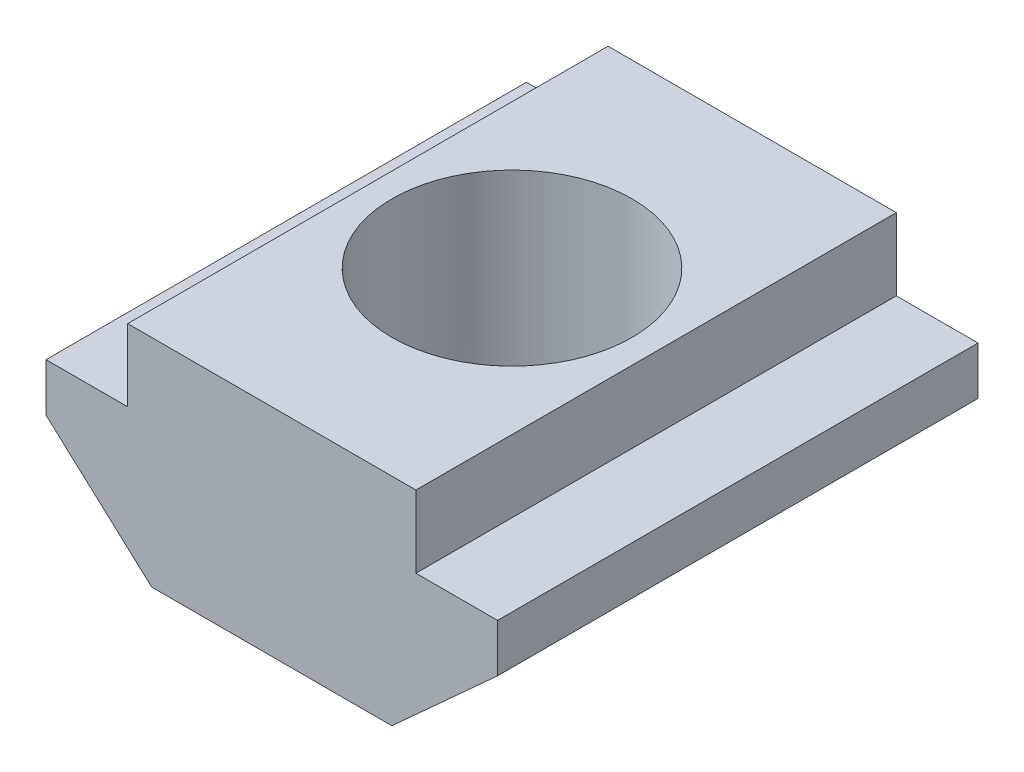
ISO-10303-21;
HEADER;
FILE_DESCRIPTION(('STEP AP214'),'2;1');
FILE_NAME('part.step','',(''),(''),'','','');
FILE_SCHEMA(('AUTOMOTIVE_DESIGN { 1 0 10303 214 1 1 1 1 }'));
ENDSEC;
DATA;
#1=APPLICATION_CONTEXT('core data for automotive mechanical design processes');
#2=APPLICATION_PROTOCOL_DEFINITION('international standard','automotive_design',2000,#1);
#3=PRODUCT_CONTEXT('',#1,'mechanical');
#4=PRODUCT('Part','Part','',(#3));
#5=PRODUCT_RELATED_PRODUCT_CATEGORY('part','',(#4));
#6=PRODUCT_DEFINITION_FORMATION('','',#4);
#7=PRODUCT_DEFINITION_CONTEXT('part definition',#1,'design');
#8=PRODUCT_DEFINITION('design','',#6,#7);
#9=PRODUCT_DEFINITION_SHAPE('','',#8);
#10=(LENGTH_UNIT() NAMED_UNIT(*) SI_UNIT(.MILLI.,.METRE.));
#11=(NAMED_UNIT(*) PLANE_ANGLE_UNIT() SI_UNIT($,.RADIAN.));
#12=(NAMED_UNIT(*) SI_UNIT($,.STERADIAN.) SOLID_ANGLE_UNIT());
#13=UNCERTAINTY_MEASURE_WITH_UNIT(LENGTH_MEASURE(1.E-05),#10,'distance_accuracy_value','');
#14=(GEOMETRIC_REPRESENTATION_CONTEXT(3) GLOBAL_UNCERTAINTY_ASSIGNED_CONTEXT((#13)) GLOBAL_UNIT_ASSIGNED_CONTEXT((#10,
#11,#12)) REPRESENTATION_CONTEXT('',''));
#15=CARTESIAN_POINT('',(0.,0.,0.));
#16=DIRECTION('',(0.,0.,1.));
#17=DIRECTION('',(1.,0.,0.));
#18=AXIS2_PLACEMENT_3D('',#15,#16,#17);
#19=CARTESIAN_POINT('',(-2.5,-4.5,5.));
#20=DIRECTION('',(0.,1.,0.));
#21=DIRECTION('',(0.,0.,1.));
#22=AXIS2_PLACEMENT_3D('',#19,#20,#21);
#23=PLANE('',#22);
#24=DIRECTION('',(0.,0.,-1.));
#25=VECTOR('',#24,1.);
#26=CARTESIAN_POINT('',(2.5,-4.5,5.));
#27=LINE('',#26,#25);
#28=CARTESIAN_POINT('',(2.5,-4.5,0.));
#29=VERTEX_POINT('',#28);
#30=CARTESIAN_POINT('',(2.5,-4.5,-5.));
#31=VERTEX_POINT('',#30);
#32=EDGE_CURVE('E181',#29,#31,#27,.T.);
#33=ORIENTED_EDGE('',*,*,#32,.F.);
#34=CARTESIAN_POINT('',(0.,-4.5,0.));
#35=DIRECTION('',(0.,1.,0.));
#36=DIRECTION('',(0.,0.,1.));
#37=AXIS2_PLACEMENT_3D('',#34,#35,#36);
#38=CIRCLE('',#37,2.5);
#39=CARTESIAN_POINT('',(-2.5,-4.5,0.));
#40=VERTEX_POINT('',#39);
#41=EDGE_CURVE('E49',#29,#40,#38,.T.);
#42=ORIENTED_EDGE('',*,*,#41,.T.);
#43=DIRECTION('',(0.,0.,-1.));
#44=VECTOR('',#43,1.);
#45=CARTESIAN_POINT('',(-2.5,-4.5,5.));
#46=LINE('',#45,#44);
#47=CARTESIAN_POINT('',(-2.5,-4.5,-5.));
#48=VERTEX_POINT('',#47);
#49=EDGE_CURVE('E185',#40,#48,#46,.T.);
#50=ORIENTED_EDGE('',*,*,#49,.T.);
#51=DIRECTION('',(1.,0.,0.));
#52=VECTOR('',#51,1.);
#53=CARTESIAN_POINT('',(-2.5,-4.5,-5.));
#54=LINE('',#53,#52);
#55=EDGE_CURVE('E163',#48,#31,#54,.T.);
#56=ORIENTED_EDGE('',*,*,#55,.T.);
#57=EDGE_LOOP('',(#33,#42,#50,#56));
#58=FACE_BOUND('',#57,.T.);
#59=ADVANCED_FACE('F35',(#58),#23,.F.);
#60=CARTESIAN_POINT('',(-3.,0.,5.));
#61=DIRECTION('',(1.,0.,0.));
#62=DIRECTION('',(0.,1.,0.));
#63=AXIS2_PLACEMENT_3D('',#60,#61,#62);
#64=PLANE('',#63);
#65=DIRECTION('',(0.,-1.,0.));
#66=VECTOR('',#65,1.);
#67=CARTESIAN_POINT('',(-3.,0.,-5.));
#68=LINE('',#67,#66);
#69=CARTESIAN_POINT('',(-3.,0.,-5.));
#70=VERTEX_POINT('',#69);
#71=CARTESIAN_POINT('',(-3.,-1.5,-5.));
#72=VERTEX_POINT('',#71);
#73=EDGE_CURVE('E153',#70,#72,#68,.T.);
#74=ORIENTED_EDGE('',*,*,#73,.T.);
#75=DIRECTION('',(0.,0.,-1.));
#76=VECTOR('',#75,1.);
#77=CARTESIAN_POINT('',(-3.,-1.5,5.));
#78=LINE('',#77,#76);
#79=CARTESIAN_POINT('',(-3.,-1.5,5.));
#80=VERTEX_POINT('',#79);
#81=EDGE_CURVE('E11',#80,#72,#78,.T.);
#82=ORIENTED_EDGE('',*,*,#81,.F.);
#83=DIRECTION('',(0.,-1.,0.));
#84=VECTOR('',#83,1.);
#85=CARTESIAN_POINT('',(-3.,0.,5.));
#86=LINE('',#85,#84);
#87=CARTESIAN_POINT('',(-3.,0.,5.));
#88=VERTEX_POINT('',#87);
#89=EDGE_CURVE('E174',#88,#80,#86,.T.);
#90=ORIENTED_EDGE('',*,*,#89,.F.);
#91=DIRECTION('',(0.,0.,-1.));
#92=VECTOR('',#91,1.);
#93=CARTESIAN_POINT('',(-3.,0.,5.));
#94=LINE('',#93,#92);
#95=EDGE_CURVE('E149',#88,#70,#94,.T.);
#96=ORIENTED_EDGE('',*,*,#95,.T.);
#97=EDGE_LOOP('',(#74,#82,#90,#96));
#98=FACE_BOUND('',#97,.T.);
#99=ADVANCED_FACE('F37',(#98),#64,.F.);
#100=CARTESIAN_POINT('',(-3.,-1.5,5.));
#101=DIRECTION('',(0.,-1.,0.));
#102=DIRECTION('',(1.,0.,0.));
#103=AXIS2_PLACEMENT_3D('',#100,#101,#102);
#104=PLANE('',#103);
#105=DIRECTION('',(-1.,0.,0.));
#106=VECTOR('',#105,1.);
#107=CARTESIAN_POINT('',(-3.,-1.5,-5.));
#108=LINE('',#107,#106);
#109=CARTESIAN_POINT('',(-4.7,-1.5,-5.));
#110=VERTEX_POINT('',#109);
#111=EDGE_CURVE('E156',#72,#110,#108,.T.);
#112=ORIENTED_EDGE('',*,*,#111,.T.);
#113=DIRECTION('',(0.,0.,-1.));
#114=VECTOR('',#113,1.);
#115=CARTESIAN_POINT('',(-4.7,-1.5,5.));
#116=LINE('',#115,#114);
#117=CARTESIAN_POINT('',(-4.7,-1.5,5.));
#118=VERTEX_POINT('',#117);
#119=EDGE_CURVE('E43',#118,#110,#116,.T.);
#120=ORIENTED_EDGE('',*,*,#119,.F.);
#121=DIRECTION('',(-1.,0.,0.));
#122=VECTOR('',#121,1.);
#123=CARTESIAN_POINT('',(-3.,-1.5,5.));
#124=LINE('',#123,#122);
#125=EDGE_CURVE('E105',#80,#118,#124,.T.);
#126=ORIENTED_EDGE('',*,*,#125,.F.);
#127=ORIENTED_EDGE('',*,*,#81,.T.);
#128=EDGE_LOOP('',(#112,#120,#126,#127));
#129=FACE_BOUND('',#128,.T.);
#130=ADVANCED_FACE('F245',(#129),#104,.F.);
#131=CARTESIAN_POINT('',(-4.7,-1.5,5.));
#132=DIRECTION('',(1.,0.,0.));
#133=DIRECTION('',(0.,1.,0.));
#134=AXIS2_PLACEMENT_3D('',#131,#132,#133);
#135=PLANE('',#134);
#136=DIRECTION('',(0.,-1.,0.));
#137=VECTOR('',#136,1.);
#138=CARTESIAN_POINT('',(-4.7,-1.5,-5.));
#139=LINE('',#138,#137);
#140=CARTESIAN_POINT('',(-4.7,-2.5,-5.));
#141=VERTEX_POINT('',#140);
#142=EDGE_CURVE('E158',#110,#141,#139,.T.);
#143=ORIENTED_EDGE('',*,*,#142,.T.);
#144=DIRECTION('',(0.,0.,-1.));
#145=VECTOR('',#144,1.);
#146=CARTESIAN_POINT('',(-4.7,-2.5,5.));
#147=LINE('',#146,#145);
#148=CARTESIAN_POINT('',(-4.7,-2.5,5.));
#149=VERTEX_POINT('',#148);
#150=EDGE_CURVE('E189',#149,#141,#147,.T.);
#151=ORIENTED_EDGE('',*,*,#150,.F.);
#152=DIRECTION('',(0.,-1.,0.));
#153=VECTOR('',#152,1.);
#154=CARTESIAN_POINT('',(-4.7,-1.5,5.));
#155=LINE('',#154,#153);
#156=EDGE_CURVE('E197',#118,#149,#155,.T.);
#157=ORIENTED_EDGE('',*,*,#156,.F.);
#158=ORIENTED_EDGE('',*,*,#119,.T.);
#159=EDGE_LOOP('',(#143,#151,#157,#158));
#160=FACE_BOUND('',#159,.T.);
#161=ADVANCED_FACE('F195',(#160),#135,.F.);
#162=CARTESIAN_POINT('',(-4.7,-2.5,5.));
#163=DIRECTION('',(0.672672793996312,0.739940073395944,0.));
#164=DIRECTION('',(-0.739940073395944,0.672672793996312,0.));
#165=AXIS2_PLACEMENT_3D('',#162,#163,#164);
#166=PLANE('',#165);
#167=DIRECTION('',(0.739940073395944,-0.672672793996312,0.));
#168=VECTOR('',#167,1.);
#169=CARTESIAN_POINT('',(-4.7,-2.5,-5.));
#170=LINE('',#169,#168);
#171=EDGE_CURVE('E160',#141,#48,#170,.T.);
#172=ORIENTED_EDGE('',*,*,#171,.T.);
#173=ORIENTED_EDGE('',*,*,#49,.F.);
#174=CARTESIAN_POINT('',(-2.5,-4.5,5.));
#175=VERTEX_POINT('',#174);
#176=EDGE_CURVE('E186',#175,#40,#46,.T.);
#177=ORIENTED_EDGE('',*,*,#176,.F.);
#178=DIRECTION('',(0.739940073395944,-0.672672793996312,0.));
#179=VECTOR('',#178,1.);
#180=CARTESIAN_POINT('',(-4.7,-2.5,5.));
#181=LINE('',#180,#179);
#182=EDGE_CURVE('E209',#149,#175,#181,.T.);
#183=ORIENTED_EDGE('',*,*,#182,.F.);
#184=ORIENTED_EDGE('',*,*,#150,.T.);
#185=EDGE_LOOP('',(#172,#173,#177,#183,#184));
#186=FACE_BOUND('',#185,.T.);
#187=ADVANCED_FACE('F206',(#186),#166,.F.);
#188=ORIENTED_EDGE('',*,*,#176,.T.);
#189=EDGE_CURVE('E235',#40,#29,#38,.T.);
#190=ORIENTED_EDGE('',*,*,#189,.T.);
#191=CARTESIAN_POINT('',(2.5,-4.5,5.));
#192=VERTEX_POINT('',#191);
#193=EDGE_CURVE('E182',#192,#29,#27,.T.);
#194=ORIENTED_EDGE('',*,*,#193,.F.);
#195=DIRECTION('',(1.,0.,0.));
#196=VECTOR('',#195,1.);
#197=CARTESIAN_POINT('',(-2.5,-4.5,5.));
#198=LINE('',#197,#196);
#199=EDGE_CURVE('E211',#175,#192,#198,.T.);
#200=ORIENTED_EDGE('',*,*,#199,.F.);
#201=EDGE_LOOP('',(#188,#190,#194,#200));
#202=FACE_BOUND('',#201,.T.);
#203=ADVANCED_FACE('F239',(#202),#23,.F.);
#204=CARTESIAN_POINT('',(4.7,-2.5,5.));
#205=DIRECTION('',(-0.672672793996312,0.739940073395944,0.));
#206=DIRECTION('',(-0.739940073395944,-0.672672793996312,0.));
#207=AXIS2_PLACEMENT_3D('',#204,#205,#206);
#208=PLANE('',#207);
#209=DIRECTION('',(0.739940073395944,0.672672793996312,0.));
#210=VECTOR('',#209,1.);
#211=CARTESIAN_POINT('',(4.7,-2.5,-5.));
#212=LINE('',#211,#210);
#213=CARTESIAN_POINT('',(4.7,-2.5,-5.));
#214=VERTEX_POINT('',#213);
#215=EDGE_CURVE('E166',#31,#214,#212,.T.);
#216=ORIENTED_EDGE('',*,*,#215,.T.);
#217=DIRECTION('',(0.,0.,-1.));
#218=VECTOR('',#217,1.);
#219=CARTESIAN_POINT('',(4.7,-2.5,5.));
#220=LINE('',#219,#218);
#221=CARTESIAN_POINT('',(4.7,-2.5,5.));
#222=VERTEX_POINT('',#221);
#223=EDGE_CURVE('E178',#222,#214,#220,.T.);
#224=ORIENTED_EDGE('',*,*,#223,.F.);
#225=DIRECTION('',(0.739940073395944,0.672672793996312,0.));
#226=VECTOR('',#225,1.);
#227=CARTESIAN_POINT('',(4.7,-2.5,5.));
#228=LINE('',#227,#226);
#229=EDGE_CURVE('E213',#192,#222,#228,.T.);
#230=ORIENTED_EDGE('',*,*,#229,.F.);
#231=ORIENTED_EDGE('',*,*,#193,.T.);
#232=ORIENTED_EDGE('',*,*,#32,.T.);
#233=EDGE_LOOP('',(#216,#224,#230,#231,#232));
#234=FACE_BOUND('',#233,.T.);
#235=ADVANCED_FACE('F222',(#234),#208,.F.);
#236=CARTESIAN_POINT('',(4.7,-1.5,5.));
#237=DIRECTION('',(-1.,0.,0.));
#238=DIRECTION('',(0.,-1.,0.));
#239=AXIS2_PLACEMENT_3D('',#236,#237,#238);
#240=PLANE('',#239);
#241=DIRECTION('',(0.,1.,0.));
#242=VECTOR('',#241,1.);
#243=CARTESIAN_POINT('',(4.7,-1.5,-5.));
#244=LINE('',#243,#242);
#245=CARTESIAN_POINT('',(4.7,-1.5,-5.));
#246=VERTEX_POINT('',#245);
#247=EDGE_CURVE('E168',#214,#246,#244,.T.);
#248=ORIENTED_EDGE('',*,*,#247,.T.);
#249=DIRECTION('',(0.,0.,-1.));
#250=VECTOR('',#249,1.);
#251=CARTESIAN_POINT('',(4.7,-1.5,5.));
#252=LINE('',#251,#250);
#253=CARTESIAN_POINT('',(4.7,-1.5,5.));
#254=VERTEX_POINT('',#253);
#255=EDGE_CURVE('E144',#254,#246,#252,.T.);
#256=ORIENTED_EDGE('',*,*,#255,.F.);
#257=DIRECTION('',(0.,1.,0.));
#258=VECTOR('',#257,1.);
#259=CARTESIAN_POINT('',(4.7,-1.5,5.));
#260=LINE('',#259,#258);
#261=EDGE_CURVE('E132',#222,#254,#260,.T.);
#262=ORIENTED_EDGE('',*,*,#261,.F.);
#263=ORIENTED_EDGE('',*,*,#223,.T.);
#264=EDGE_LOOP('',(#248,#256,#262,#263));
#265=FACE_BOUND('',#264,.T.);
#266=ADVANCED_FACE('F225',(#265),#240,.F.);
#267=CARTESIAN_POINT('',(3.,-1.5,5.));
#268=DIRECTION('',(0.,-1.,0.));
#269=DIRECTION('',(1.,0.,0.));
#270=AXIS2_PLACEMENT_3D('',#267,#268,#269);
#271=PLANE('',#270);
#272=DIRECTION('',(-1.,0.,0.));
#273=VECTOR('',#272,1.);
#274=CARTESIAN_POINT('',(3.,-1.5,-5.));
#275=LINE('',#274,#273);
#276=CARTESIAN_POINT('',(3.,-1.5,-5.));
#277=VERTEX_POINT('',#276);
#278=EDGE_CURVE('E141',#246,#277,#275,.T.);
#279=ORIENTED_EDGE('',*,*,#278,.T.);
#280=DIRECTION('',(0.,0.,-1.));
#281=VECTOR('',#280,1.);
#282=CARTESIAN_POINT('',(3.,-1.5,5.));
#283=LINE('',#282,#281);
#284=CARTESIAN_POINT('',(3.,-1.5,5.));
#285=VERTEX_POINT('',#284);
#286=EDGE_CURVE('E138',#285,#277,#283,.T.);
#287=ORIENTED_EDGE('',*,*,#286,.F.);
#288=DIRECTION('',(-1.,0.,0.));
#289=VECTOR('',#288,1.);
#290=CARTESIAN_POINT('',(3.,-1.5,5.));
#291=LINE('',#290,#289);
#292=EDGE_CURVE('E125',#254,#285,#291,.T.);
#293=ORIENTED_EDGE('',*,*,#292,.F.);
#294=ORIENTED_EDGE('',*,*,#255,.T.);
#295=EDGE_LOOP('',(#279,#287,#293,#294));
#296=FACE_BOUND('',#295,.T.);
#297=ADVANCED_FACE('F139',(#296),#271,.F.);
#298=CARTESIAN_POINT('',(3.,0.,5.));
#299=DIRECTION('',(-1.,0.,0.));
#300=DIRECTION('',(0.,-1.,0.));
#301=AXIS2_PLACEMENT_3D('',#298,#299,#300);
#302=PLANE('',#301);
#303=DIRECTION('',(0.,1.,0.));
#304=VECTOR('',#303,1.);
#305=CARTESIAN_POINT('',(3.,0.,-5.));
#306=LINE('',#305,#304);
#307=CARTESIAN_POINT('',(3.,0.,-5.));
#308=VERTEX_POINT('',#307);
#309=EDGE_CURVE('E171',#277,#308,#306,.T.);
#310=ORIENTED_EDGE('',*,*,#309,.T.);
#311=DIRECTION('',(0.,0.,-1.));
#312=VECTOR('',#311,1.);
#313=CARTESIAN_POINT('',(3.,0.,5.));
#314=LINE('',#313,#312);
#315=CARTESIAN_POINT('',(3.,0.,5.));
#316=VERTEX_POINT('',#315);
#317=EDGE_CURVE('E145',#316,#308,#314,.T.);
#318=ORIENTED_EDGE('',*,*,#317,.F.);
#319=DIRECTION('',(0.,1.,0.));
#320=VECTOR('',#319,1.);
#321=CARTESIAN_POINT('',(3.,0.,5.));
#322=LINE('',#321,#320);
#323=EDGE_CURVE('E129',#285,#316,#322,.T.);
#324=ORIENTED_EDGE('',*,*,#323,.F.);
#325=ORIENTED_EDGE('',*,*,#286,.T.);
#326=EDGE_LOOP('',(#310,#318,#324,#325));
#327=FACE_BOUND('',#326,.T.);
#328=ADVANCED_FACE('F147',(#327),#302,.F.);
#329=CARTESIAN_POINT('',(3.,0.,5.));
#330=DIRECTION('',(0.,-1.,0.));
#331=DIRECTION('',(0.,0.,-1.));
#332=AXIS2_PLACEMENT_3D('',#329,#330,#331);
#333=PLANE('',#332);
#334=CARTESIAN_POINT('',(0.,0.,0.));
#335=DIRECTION('',(0.,1.,0.));
#336=DIRECTION('',(0.,0.,1.));
#337=AXIS2_PLACEMENT_3D('',#334,#335,#336);
#338=CIRCLE('',#337,2.5);
#339=CARTESIAN_POINT('',(0.,0.,2.5));
#340=VERTEX_POINT('',#339);
#341=EDGE_CURVE('E232',#340,#340,#338,.T.);
#342=ORIENTED_EDGE('',*,*,#341,.F.);
#343=EDGE_LOOP('',(#342));
#344=FACE_BOUND('',#343,.T.);
#345=DIRECTION('',(-1.,0.,0.));
#346=VECTOR('',#345,1.);
#347=CARTESIAN_POINT('',(3.,0.,-5.));
#348=LINE('',#347,#346);
#349=EDGE_CURVE('E97',#308,#70,#348,.T.);
#350=ORIENTED_EDGE('',*,*,#349,.T.);
#351=ORIENTED_EDGE('',*,*,#95,.F.);
#352=DIRECTION('',(-1.,0.,0.));
#353=VECTOR('',#352,1.);
#354=CARTESIAN_POINT('',(3.,0.,5.));
#355=LINE('',#354,#353);
#356=EDGE_CURVE('E58',#316,#88,#355,.T.);
#357=ORIENTED_EDGE('',*,*,#356,.F.);
#358=ORIENTED_EDGE('',*,*,#317,.T.);
#359=EDGE_LOOP('',(#350,#351,#357,#358));
#360=FACE_BOUND('',#359,.T.);
#361=ADVANCED_FACE('F226',(#344,#360),#333,.F.);
#362=CARTESIAN_POINT('',(0.,0.,5.));
#363=DIRECTION('',(0.,0.,-1.));
#364=DIRECTION('',(-1.,0.,0.));
#365=AXIS2_PLACEMENT_3D('',#362,#363,#364);
#366=PLANE('',#365);
#367=ORIENTED_EDGE('',*,*,#89,.T.);
#368=ORIENTED_EDGE('',*,*,#125,.T.);
#369=ORIENTED_EDGE('',*,*,#156,.T.);
#370=ORIENTED_EDGE('',*,*,#182,.T.);
#371=ORIENTED_EDGE('',*,*,#199,.T.);
#372=ORIENTED_EDGE('',*,*,#229,.T.);
#373=ORIENTED_EDGE('',*,*,#261,.T.);
#374=ORIENTED_EDGE('',*,*,#292,.T.);
#375=ORIENTED_EDGE('',*,*,#323,.T.);
#376=ORIENTED_EDGE('',*,*,#356,.T.);
#377=EDGE_LOOP('',(#367,#368,#369,#370,#371,#372,#373,#374,#375,#376));
#378=FACE_BOUND('',#377,.T.);
#379=ADVANCED_FACE('F127',(#378),#366,.F.);
#380=CARTESIAN_POINT('',(0.,0.,-5.));
#381=DIRECTION('',(0.,0.,-1.));
#382=DIRECTION('',(-1.,0.,0.));
#383=AXIS2_PLACEMENT_3D('',#380,#381,#382);
#384=PLANE('',#383);
#385=ORIENTED_EDGE('',*,*,#73,.F.);
#386=ORIENTED_EDGE('',*,*,#349,.F.);
#387=ORIENTED_EDGE('',*,*,#309,.F.);
#388=ORIENTED_EDGE('',*,*,#278,.F.);
#389=ORIENTED_EDGE('',*,*,#247,.F.);
#390=ORIENTED_EDGE('',*,*,#215,.F.);
#391=ORIENTED_EDGE('',*,*,#55,.F.);
#392=ORIENTED_EDGE('',*,*,#171,.F.);
#393=ORIENTED_EDGE('',*,*,#142,.F.);
#394=ORIENTED_EDGE('',*,*,#111,.F.);
#395=EDGE_LOOP('',(#385,#386,#387,#388,#389,#390,#391,#392,#393,#394));
#396=FACE_BOUND('',#395,.T.);
#397=ADVANCED_FACE('F201',(#396),#384,.T.);
#398=CARTESIAN_POINT('',(0.,-4.5,0.));
#399=DIRECTION('',(0.,1.,0.));
#400=DIRECTION('',(0.,0.,1.));
#401=AXIS2_PLACEMENT_3D('',#398,#399,#400);
#402=CYLINDRICAL_SURFACE('',#401,2.5);
#403=ORIENTED_EDGE('',*,*,#41,.F.);
#404=ORIENTED_EDGE('',*,*,#189,.F.);
#405=EDGE_LOOP('',(#403,#404));
#406=FACE_BOUND('',#405,.T.);
#407=ORIENTED_EDGE('',*,*,#341,.T.);
#408=EDGE_LOOP('',(#407));
#409=FACE_BOUND('',#408,.T.);
#410=ADVANCED_FACE('F310',(#406,#409),#402,.F.);
#411=CLOSED_SHELL('',(#59,#99,#130,#161,#187,#203,#235,#266,#297,#328,#361,#379,#397,#410));
#412=MANIFOLD_SOLID_BREP('B2',#411);
#413=ADVANCED_BREP_SHAPE_REPRESENTATION('',(#18,#412),#14);
#414=SHAPE_DEFINITION_REPRESENTATION(#9,#413);
ENDSEC;
END-ISO-10303-21;
